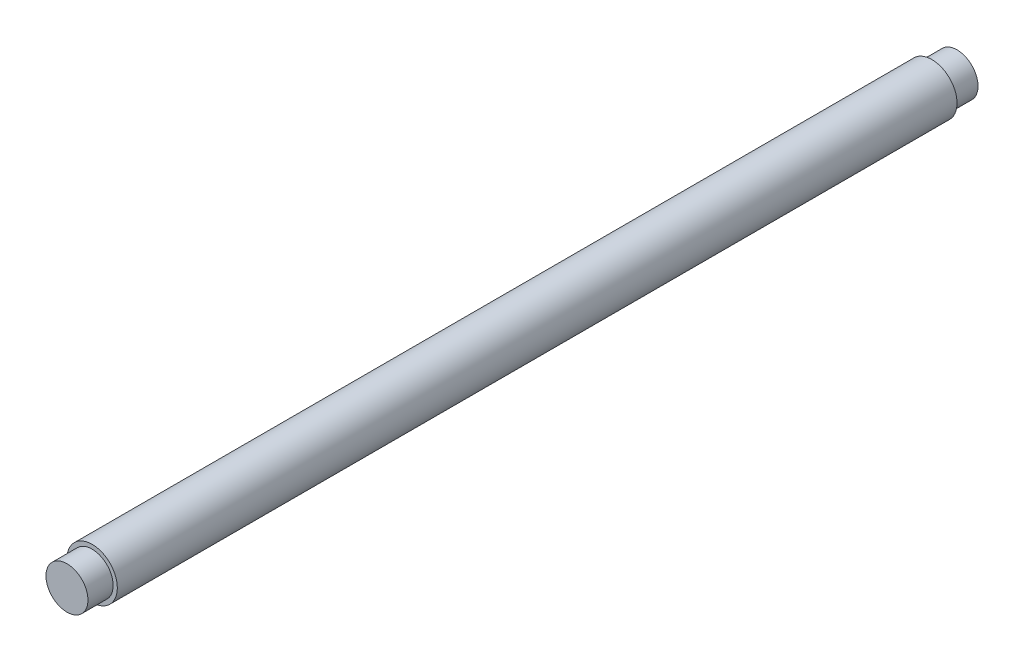
ISO-10303-21;
HEADER;
FILE_DESCRIPTION(('STEP AP214'),'2;1');
FILE_NAME('part.step','',(''),(''),'','','');
FILE_SCHEMA(('AUTOMOTIVE_DESIGN { 1 0 10303 214 1 1 1 1 }'));
ENDSEC;
DATA;
#1=APPLICATION_CONTEXT('core data for automotive mechanical design processes');
#2=APPLICATION_PROTOCOL_DEFINITION('international standard','automotive_design',2000,#1);
#3=PRODUCT_CONTEXT('',#1,'mechanical');
#4=PRODUCT('Part','Part','',(#3));
#5=PRODUCT_RELATED_PRODUCT_CATEGORY('part','',(#4));
#6=PRODUCT_DEFINITION_FORMATION('','',#4);
#7=PRODUCT_DEFINITION_CONTEXT('part definition',#1,'design');
#8=PRODUCT_DEFINITION('design','',#6,#7);
#9=PRODUCT_DEFINITION_SHAPE('','',#8);
#10=(LENGTH_UNIT() NAMED_UNIT(*) SI_UNIT(.MILLI.,.METRE.));
#11=(NAMED_UNIT(*) PLANE_ANGLE_UNIT() SI_UNIT($,.RADIAN.));
#12=(NAMED_UNIT(*) SI_UNIT($,.STERADIAN.) SOLID_ANGLE_UNIT());
#13=UNCERTAINTY_MEASURE_WITH_UNIT(LENGTH_MEASURE(1.E-05),#10,'distance_accuracy_value','');
#14=(GEOMETRIC_REPRESENTATION_CONTEXT(3) GLOBAL_UNCERTAINTY_ASSIGNED_CONTEXT((#13)) GLOBAL_UNIT_ASSIGNED_CONTEXT((#10,
#11,#12)) REPRESENTATION_CONTEXT('',''));
#15=CARTESIAN_POINT('',(0.,0.,0.));
#16=DIRECTION('',(0.,0.,1.));
#17=DIRECTION('',(1.,0.,0.));
#18=AXIS2_PLACEMENT_3D('',#15,#16,#17);
#19=CARTESIAN_POINT('',(0.,0.,75.));
#20=DIRECTION('',(0.,0.,-1.));
#21=DIRECTION('',(-1.,0.,0.));
#22=AXIS2_PLACEMENT_3D('',#19,#20,#21);
#23=CYLINDRICAL_SURFACE('',#22,3.);
#24=CARTESIAN_POINT('',(0.,0.,-28.));
#25=DIRECTION('',(0.,0.,-1.));
#26=DIRECTION('',(-1.,0.,0.));
#27=AXIS2_PLACEMENT_3D('',#24,#25,#26);
#28=CIRCLE('',#27,3.);
#29=CARTESIAN_POINT('',(-3.,0.,-28.));
#30=VERTEX_POINT('',#29);
#31=EDGE_CURVE('E12',#30,#30,#28,.T.);
#32=ORIENTED_EDGE('',*,*,#31,.F.);
#33=EDGE_LOOP('',(#32));
#34=FACE_BOUND('',#33,.T.);
#35=CARTESIAN_POINT('',(0.,0.,72.));
#36=DIRECTION('',(0.,0.,1.));
#37=DIRECTION('',(1.,0.,0.));
#38=AXIS2_PLACEMENT_3D('',#35,#36,#37);
#39=CIRCLE('',#38,3.);
#40=CARTESIAN_POINT('',(3.,0.,72.));
#41=VERTEX_POINT('',#40);
#42=EDGE_CURVE('E52',#41,#41,#39,.T.);
#43=ORIENTED_EDGE('',*,*,#42,.F.);
#44=EDGE_LOOP('',(#43));
#45=FACE_BOUND('',#44,.T.);
#46=ADVANCED_FACE('F49',(#34,#45),#23,.T.);
#47=CARTESIAN_POINT('',(0.,0.,-28.));
#48=DIRECTION('',(0.,0.,-1.));
#49=DIRECTION('',(-1.,0.,0.));
#50=AXIS2_PLACEMENT_3D('',#47,#48,#49);
#51=PLANE('',#50);
#52=CARTESIAN_POINT('',(0.,0.,-28.));
#53=DIRECTION('',(0.,0.,-1.));
#54=DIRECTION('',(-1.,0.,0.));
#55=AXIS2_PLACEMENT_3D('',#52,#53,#54);
#56=CIRCLE('',#55,2.5);
#57=CARTESIAN_POINT('',(-2.5,0.,-28.));
#58=VERTEX_POINT('',#57);
#59=EDGE_CURVE('E57',#58,#58,#56,.T.);
#60=ORIENTED_EDGE('',*,*,#59,.F.);
#61=EDGE_LOOP('',(#60));
#62=FACE_BOUND('',#61,.T.);
#63=ORIENTED_EDGE('',*,*,#31,.T.);
#64=EDGE_LOOP('',(#63));
#65=FACE_BOUND('',#64,.T.);
#66=ADVANCED_FACE('F84',(#62,#65),#51,.T.);
#67=CARTESIAN_POINT('',(0.,0.,-28.));
#68=DIRECTION('',(0.,0.,-1.));
#69=DIRECTION('',(-1.,0.,0.));
#70=AXIS2_PLACEMENT_3D('',#67,#68,#69);
#71=CYLINDRICAL_SURFACE('',#70,2.5);
#72=ORIENTED_EDGE('',*,*,#59,.T.);
#73=EDGE_LOOP('',(#72));
#74=FACE_BOUND('',#73,.T.);
#75=CARTESIAN_POINT('',(0.,0.,-31.));
#76=DIRECTION('',(0.,0.,-1.));
#77=DIRECTION('',(-1.,0.,0.));
#78=AXIS2_PLACEMENT_3D('',#75,#76,#77);
#79=CIRCLE('',#78,2.5);
#80=CARTESIAN_POINT('',(-2.5,0.,-31.));
#81=VERTEX_POINT('',#80);
#82=EDGE_CURVE('E62',#81,#81,#79,.T.);
#83=ORIENTED_EDGE('',*,*,#82,.F.);
#84=EDGE_LOOP('',(#83));
#85=FACE_BOUND('',#84,.T.);
#86=ADVANCED_FACE('F91',(#74,#85),#71,.T.);
#87=CARTESIAN_POINT('',(0.,0.,-31.));
#88=DIRECTION('',(0.,0.,1.));
#89=DIRECTION('',(1.,0.,0.));
#90=AXIS2_PLACEMENT_3D('',#87,#88,#89);
#91=PLANE('',#90);
#92=ORIENTED_EDGE('',*,*,#82,.T.);
#93=EDGE_LOOP('',(#92));
#94=FACE_BOUND('',#93,.T.);
#95=ADVANCED_FACE('F97',(#94),#91,.F.);
#96=CARTESIAN_POINT('',(0.,0.,72.));
#97=DIRECTION('',(0.,0.,1.));
#98=DIRECTION('',(1.,0.,0.));
#99=AXIS2_PLACEMENT_3D('',#96,#97,#98);
#100=PLANE('',#99);
#101=CARTESIAN_POINT('',(0.,0.,72.));
#102=DIRECTION('',(0.,0.,1.));
#103=DIRECTION('',(1.,0.,0.));
#104=AXIS2_PLACEMENT_3D('',#101,#102,#103);
#105=CIRCLE('',#104,2.5);
#106=CARTESIAN_POINT('',(2.5,0.,72.));
#107=VERTEX_POINT('',#106);
#108=EDGE_CURVE('E72',#107,#107,#105,.T.);
#109=ORIENTED_EDGE('',*,*,#108,.F.);
#110=EDGE_LOOP('',(#109));
#111=FACE_BOUND('',#110,.T.);
#112=ORIENTED_EDGE('',*,*,#42,.T.);
#113=EDGE_LOOP('',(#112));
#114=FACE_BOUND('',#113,.T.);
#115=ADVANCED_FACE('F81',(#111,#114),#100,.T.);
#116=CARTESIAN_POINT('',(0.,0.,72.));
#117=DIRECTION('',(0.,0.,1.));
#118=DIRECTION('',(1.,0.,0.));
#119=AXIS2_PLACEMENT_3D('',#116,#117,#118);
#120=CYLINDRICAL_SURFACE('',#119,2.5);
#121=ORIENTED_EDGE('',*,*,#108,.T.);
#122=EDGE_LOOP('',(#121));
#123=FACE_BOUND('',#122,.T.);
#124=CARTESIAN_POINT('',(0.,0.,75.));
#125=DIRECTION('',(0.,0.,1.));
#126=DIRECTION('',(1.,0.,0.));
#127=AXIS2_PLACEMENT_3D('',#124,#125,#126);
#128=CIRCLE('',#127,2.5);
#129=CARTESIAN_POINT('',(2.5,0.,75.));
#130=VERTEX_POINT('',#129);
#131=EDGE_CURVE('E68',#130,#130,#128,.T.);
#132=ORIENTED_EDGE('',*,*,#131,.F.);
#133=EDGE_LOOP('',(#132));
#134=FACE_BOUND('',#133,.T.);
#135=ADVANCED_FACE('F106',(#123,#134),#120,.T.);
#136=CARTESIAN_POINT('',(0.,0.,75.));
#137=DIRECTION('',(0.,0.,1.));
#138=DIRECTION('',(1.,0.,0.));
#139=AXIS2_PLACEMENT_3D('',#136,#137,#138);
#140=PLANE('',#139);
#141=ORIENTED_EDGE('',*,*,#131,.T.);
#142=EDGE_LOOP('',(#141));
#143=FACE_BOUND('',#142,.T.);
#144=ADVANCED_FACE('F104',(#143),#140,.T.);
#145=CLOSED_SHELL('',(#46,#66,#86,#95,#115,#135,#144));
#146=MANIFOLD_SOLID_BREP('B2',#145);
#147=ADVANCED_BREP_SHAPE_REPRESENTATION('',(#18,#146),#14);
#148=SHAPE_DEFINITION_REPRESENTATION(#9,#147);
ENDSEC;
END-ISO-10303-21;
